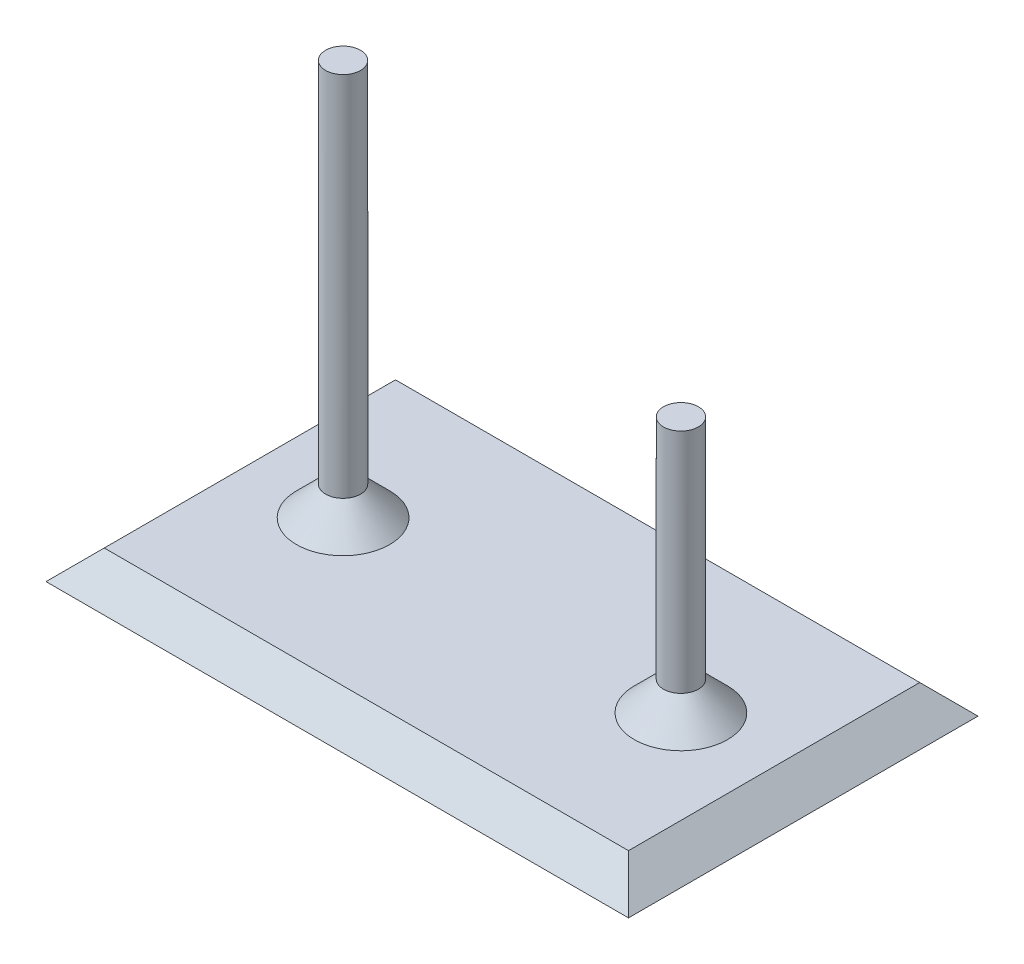
ISO-10303-21;
HEADER;
FILE_DESCRIPTION(('STEP AP214'),'2;1');
FILE_NAME('part.step','',(''),(''),'','','');
FILE_SCHEMA(('AUTOMOTIVE_DESIGN { 1 0 10303 214 1 1 1 1 }'));
ENDSEC;
DATA;
#1=APPLICATION_CONTEXT('core data for automotive mechanical design processes');
#2=APPLICATION_PROTOCOL_DEFINITION('international standard','automotive_design',2000,#1);
#3=PRODUCT_CONTEXT('',#1,'mechanical');
#4=PRODUCT('Part','Part','',(#3));
#5=PRODUCT_RELATED_PRODUCT_CATEGORY('part','',(#4));
#6=PRODUCT_DEFINITION_FORMATION('','',#4);
#7=PRODUCT_DEFINITION_CONTEXT('part definition',#1,'design');
#8=PRODUCT_DEFINITION('design','',#6,#7);
#9=PRODUCT_DEFINITION_SHAPE('','',#8);
#10=(LENGTH_UNIT() NAMED_UNIT(*) SI_UNIT(.MILLI.,.METRE.));
#11=(NAMED_UNIT(*) PLANE_ANGLE_UNIT() SI_UNIT($,.RADIAN.));
#12=(NAMED_UNIT(*) SI_UNIT($,.STERADIAN.) SOLID_ANGLE_UNIT());
#13=UNCERTAINTY_MEASURE_WITH_UNIT(LENGTH_MEASURE(1.E-05),#10,'distance_accuracy_value','');
#14=(GEOMETRIC_REPRESENTATION_CONTEXT(3) GLOBAL_UNCERTAINTY_ASSIGNED_CONTEXT((#13)) GLOBAL_UNIT_ASSIGNED_CONTEXT((#10,
#11,#12)) REPRESENTATION_CONTEXT('',''));
#15=CARTESIAN_POINT('',(0.,0.,0.));
#16=DIRECTION('',(0.,0.,1.));
#17=DIRECTION('',(1.,0.,0.));
#18=AXIS2_PLACEMENT_3D('',#15,#16,#17);
#19=CARTESIAN_POINT('',(0.,3.175,0.));
#20=DIRECTION('',(0.,1.,0.));
#21=DIRECTION('',(0.,0.,1.));
#22=AXIS2_PLACEMENT_3D('',#19,#20,#21);
#23=PLANE('',#22);
#24=DIRECTION('',(0.,0.,-1.));
#25=VECTOR('',#24,1.);
#26=CARTESIAN_POINT('',(60.325,3.175,-38.1));
#27=LINE('',#26,#25);
#28=CARTESIAN_POINT('',(60.325,3.175,-3.17499999999999));
#29=VERTEX_POINT('',#28);
#30=CARTESIAN_POINT('',(60.325,3.175,-34.925));
#31=VERTEX_POINT('',#30);
#32=EDGE_CURVE('E50',#29,#31,#27,.T.);
#33=ORIENTED_EDGE('',*,*,#32,.T.);
#34=DIRECTION('',(-1.,0.,0.));
#35=VECTOR('',#34,1.);
#36=CARTESIAN_POINT('',(0.,3.175,-34.925));
#37=LINE('',#36,#35);
#38=CARTESIAN_POINT('',(3.17499999999998,3.175,-34.925));
#39=VERTEX_POINT('',#38);
#40=EDGE_CURVE('E116',#31,#39,#37,.T.);
#41=ORIENTED_EDGE('',*,*,#40,.T.);
#42=DIRECTION('',(0.,0.,1.));
#43=VECTOR('',#42,1.);
#44=CARTESIAN_POINT('',(3.17499999999999,3.175,0.));
#45=LINE('',#44,#43);
#46=CARTESIAN_POINT('',(3.17499999999999,3.175,-3.17499999999999));
#47=VERTEX_POINT('',#46);
#48=EDGE_CURVE('E112',#39,#47,#45,.T.);
#49=ORIENTED_EDGE('',*,*,#48,.T.);
#50=DIRECTION('',(1.,0.,0.));
#51=VECTOR('',#50,1.);
#52=CARTESIAN_POINT('',(63.5,3.175,-3.17499999999999));
#53=LINE('',#52,#51);
#54=EDGE_CURVE('E55',#47,#29,#53,.T.);
#55=ORIENTED_EDGE('',*,*,#54,.T.);
#56=EDGE_LOOP('',(#33,#41,#49,#55));
#57=FACE_BOUND('',#56,.T.);
#58=CARTESIAN_POINT('',(13.335,3.175,-19.05));
#59=DIRECTION('',(0.,1.,0.));
#60=DIRECTION('',(0.,0.,1.));
#61=AXIS2_PLACEMENT_3D('',#58,#59,#60);
#62=CIRCLE('',#61,5.07999999999999);
#63=CARTESIAN_POINT('',(13.335,3.175,-24.13));
#64=VERTEX_POINT('',#63);
#65=EDGE_CURVE('E109',#64,#64,#62,.F.);
#66=ORIENTED_EDGE('',*,*,#65,.T.);
#67=EDGE_LOOP('',(#66));
#68=FACE_BOUND('',#67,.T.);
#69=CARTESIAN_POINT('',(50.165,3.175,-19.05));
#70=DIRECTION('',(0.,1.,0.));
#71=DIRECTION('',(0.,0.,1.));
#72=AXIS2_PLACEMENT_3D('',#69,#70,#71);
#73=CIRCLE('',#72,5.07999999999999);
#74=CARTESIAN_POINT('',(50.165,3.175,-24.13));
#75=VERTEX_POINT('',#74);
#76=EDGE_CURVE('E106',#75,#75,#73,.F.);
#77=ORIENTED_EDGE('',*,*,#76,.T.);
#78=EDGE_LOOP('',(#77));
#79=FACE_BOUND('',#78,.T.);
#80=ADVANCED_FACE('F33',(#57,#68,#79),#23,.T.);
#81=CARTESIAN_POINT('',(0.,0.,0.));
#82=DIRECTION('',(0.,1.,0.));
#83=DIRECTION('',(0.,0.,1.));
#84=AXIS2_PLACEMENT_3D('',#81,#82,#83);
#85=PLANE('',#84);
#86=DIRECTION('',(0.,0.,1.));
#87=VECTOR('',#86,1.);
#88=CARTESIAN_POINT('',(0.,0.,-38.1));
#89=LINE('',#88,#87);
#90=CARTESIAN_POINT('',(0.,0.,-38.1));
#91=VERTEX_POINT('',#90);
#92=CARTESIAN_POINT('',(0.,0.,0.));
#93=VERTEX_POINT('',#92);
#94=EDGE_CURVE('E80',#91,#93,#89,.T.);
#95=ORIENTED_EDGE('',*,*,#94,.F.);
#96=DIRECTION('',(-1.,0.,0.));
#97=VECTOR('',#96,1.);
#98=CARTESIAN_POINT('',(0.,0.,-38.1));
#99=LINE('',#98,#97);
#100=CARTESIAN_POINT('',(63.5,0.,-38.1));
#101=VERTEX_POINT('',#100);
#102=EDGE_CURVE('E104',#101,#91,#99,.T.);
#103=ORIENTED_EDGE('',*,*,#102,.F.);
#104=DIRECTION('',(0.,0.,-1.));
#105=VECTOR('',#104,1.);
#106=CARTESIAN_POINT('',(63.5,0.,-38.1));
#107=LINE('',#106,#105);
#108=CARTESIAN_POINT('',(63.5,0.,0.));
#109=VERTEX_POINT('',#108);
#110=EDGE_CURVE('E83',#109,#101,#107,.T.);
#111=ORIENTED_EDGE('',*,*,#110,.F.);
#112=DIRECTION('',(1.,0.,0.));
#113=VECTOR('',#112,1.);
#114=CARTESIAN_POINT('',(0.,0.,0.));
#115=LINE('',#114,#113);
#116=EDGE_CURVE('E75',#93,#109,#115,.T.);
#117=ORIENTED_EDGE('',*,*,#116,.F.);
#118=EDGE_LOOP('',(#95,#103,#111,#117));
#119=FACE_BOUND('',#118,.T.);
#120=ADVANCED_FACE('F77',(#119),#85,.F.);
#121=CARTESIAN_POINT('',(13.335,31.115,-19.05));
#122=DIRECTION('',(0.,-1.,0.));
#123=DIRECTION('',(0.,0.,-1.));
#124=AXIS2_PLACEMENT_3D('',#121,#122,#123);
#125=CYLINDRICAL_SURFACE('',#124,1.905);
#126=CARTESIAN_POINT('',(13.335,6.35000000000002,-19.05));
#127=DIRECTION('',(0.,1.,0.));
#128=DIRECTION('',(0.,0.,1.));
#129=AXIS2_PLACEMENT_3D('',#126,#127,#128);
#130=CIRCLE('',#129,1.905);
#131=CARTESIAN_POINT('',(13.335,6.35000000000002,-20.955));
#132=VERTEX_POINT('',#131);
#133=EDGE_CURVE('E42',#132,#132,#130,.T.);
#134=ORIENTED_EDGE('',*,*,#133,.T.);
#135=EDGE_LOOP('',(#134));
#136=FACE_BOUND('',#135,.T.);
#137=CARTESIAN_POINT('',(13.335,46.355,-19.05));
#138=DIRECTION('',(0.,1.,0.));
#139=DIRECTION('',(0.,0.,1.));
#140=AXIS2_PLACEMENT_3D('',#137,#138,#139);
#141=CIRCLE('',#140,1.905);
#142=CARTESIAN_POINT('',(13.335,46.355,-17.145));
#143=VERTEX_POINT('',#142);
#144=EDGE_CURVE('E99',#143,#143,#141,.T.);
#145=ORIENTED_EDGE('',*,*,#144,.F.);
#146=EDGE_LOOP('',(#145));
#147=FACE_BOUND('',#146,.T.);
#148=ADVANCED_FACE('F131',(#136,#147),#125,.T.);
#149=CARTESIAN_POINT('',(50.165,31.115,-19.05));
#150=DIRECTION('',(0.,-1.,0.));
#151=DIRECTION('',(0.,0.,-1.));
#152=AXIS2_PLACEMENT_3D('',#149,#150,#151);
#153=CYLINDRICAL_SURFACE('',#152,1.905);
#154=CARTESIAN_POINT('',(50.165,6.35000000000002,-19.05));
#155=DIRECTION('',(0.,1.,0.));
#156=DIRECTION('',(0.,0.,1.));
#157=AXIS2_PLACEMENT_3D('',#154,#155,#156);
#158=CIRCLE('',#157,1.905);
#159=CARTESIAN_POINT('',(50.165,6.35000000000002,-20.955));
#160=VERTEX_POINT('',#159);
#161=EDGE_CURVE('E11',#160,#160,#158,.T.);
#162=ORIENTED_EDGE('',*,*,#161,.T.);
#163=EDGE_LOOP('',(#162));
#164=FACE_BOUND('',#163,.T.);
#165=CARTESIAN_POINT('',(50.165,31.115,-19.05));
#166=DIRECTION('',(0.,1.,0.));
#167=DIRECTION('',(0.,0.,1.));
#168=AXIS2_PLACEMENT_3D('',#165,#166,#167);
#169=CIRCLE('',#168,1.905);
#170=CARTESIAN_POINT('',(50.165,31.115,-17.145));
#171=VERTEX_POINT('',#170);
#172=EDGE_CURVE('E96',#171,#171,#169,.T.);
#173=ORIENTED_EDGE('',*,*,#172,.F.);
#174=EDGE_LOOP('',(#173));
#175=FACE_BOUND('',#174,.T.);
#176=ADVANCED_FACE('F133',(#164,#175),#153,.T.);
#177=CARTESIAN_POINT('',(50.165,31.115,-19.05));
#178=DIRECTION('',(0.,1.,0.));
#179=DIRECTION('',(0.,0.,1.));
#180=AXIS2_PLACEMENT_3D('',#177,#178,#179);
#181=PLANE('',#180);
#182=ORIENTED_EDGE('',*,*,#172,.T.);
#183=EDGE_LOOP('',(#182));
#184=FACE_BOUND('',#183,.T.);
#185=ADVANCED_FACE('F140',(#184),#181,.T.);
#186=CARTESIAN_POINT('',(13.335,46.355,-19.05));
#187=DIRECTION('',(0.,1.,0.));
#188=DIRECTION('',(0.,0.,1.));
#189=AXIS2_PLACEMENT_3D('',#186,#187,#188);
#190=PLANE('',#189);
#191=ORIENTED_EDGE('',*,*,#144,.T.);
#192=EDGE_LOOP('',(#191));
#193=FACE_BOUND('',#192,.T.);
#194=ADVANCED_FACE('F129',(#193),#190,.T.);
#195=CARTESIAN_POINT('',(0.,3.175,-3.17499999999999));
#196=DIRECTION('',(0.,0.707106781186546,0.707106781186549));
#197=DIRECTION('',(-1.,0.,0.));
#198=AXIS2_PLACEMENT_3D('',#195,#196,#197);
#199=PLANE('',#198);
#200=DIRECTION('',(0.577350269189625,0.577350269189628,-0.577350269189625));
#201=VECTOR('',#200,1.);
#202=CARTESIAN_POINT('',(2.11666666666666,2.11666666666667,-2.11666666666666));
#203=LINE('',#202,#201);
#204=EDGE_CURVE('E88',#93,#47,#203,.T.);
#205=ORIENTED_EDGE('',*,*,#204,.F.);
#206=ORIENTED_EDGE('',*,*,#116,.T.);
#207=DIRECTION('',(-0.577350269189625,0.577350269189628,-0.577350269189625));
#208=VECTOR('',#207,1.);
#209=CARTESIAN_POINT('',(40.2166666666667,23.2833333333334,-23.2833333333333));
#210=LINE('',#209,#208);
#211=EDGE_CURVE('E37',#29,#109,#210,.F.);
#212=ORIENTED_EDGE('',*,*,#211,.F.);
#213=ORIENTED_EDGE('',*,*,#54,.F.);
#214=EDGE_LOOP('',(#205,#206,#212,#213));
#215=FACE_BOUND('',#214,.T.);
#216=ADVANCED_FACE('F89',(#215),#199,.T.);
#217=CARTESIAN_POINT('',(60.325,3.175,0.));
#218=DIRECTION('',(0.707106781186549,0.707106781186546,0.));
#219=DIRECTION('',(0.,0.,1.));
#220=AXIS2_PLACEMENT_3D('',#217,#218,#219);
#221=PLANE('',#220);
#222=ORIENTED_EDGE('',*,*,#211,.T.);
#223=ORIENTED_EDGE('',*,*,#110,.T.);
#224=DIRECTION('',(-0.577350269189625,0.577350269189628,0.577350269189625));
#225=VECTOR('',#224,1.);
#226=CARTESIAN_POINT('',(48.6833333333334,14.8166666666667,-23.2833333333334));
#227=LINE('',#226,#225);
#228=EDGE_CURVE('E92',#31,#101,#227,.F.);
#229=ORIENTED_EDGE('',*,*,#228,.F.);
#230=ORIENTED_EDGE('',*,*,#32,.F.);
#231=EDGE_LOOP('',(#222,#223,#229,#230));
#232=FACE_BOUND('',#231,.T.);
#233=ADVANCED_FACE('F125',(#232),#221,.T.);
#234=CARTESIAN_POINT('',(3.17499999999999,3.175,0.));
#235=DIRECTION('',(-0.707106781186549,0.707106781186546,0.));
#236=DIRECTION('',(0.,0.,-1.));
#237=AXIS2_PLACEMENT_3D('',#234,#235,#236);
#238=PLANE('',#237);
#239=ORIENTED_EDGE('',*,*,#204,.T.);
#240=ORIENTED_EDGE('',*,*,#48,.F.);
#241=DIRECTION('',(-0.577350269189625,-0.577350269189627,-0.577350269189625));
#242=VECTOR('',#241,1.);
#243=CARTESIAN_POINT('',(14.8166666666666,14.8166666666667,-23.2833333333334));
#244=LINE('',#243,#242);
#245=EDGE_CURVE('E95',#91,#39,#244,.F.);
#246=ORIENTED_EDGE('',*,*,#245,.F.);
#247=ORIENTED_EDGE('',*,*,#94,.T.);
#248=EDGE_LOOP('',(#239,#240,#246,#247));
#249=FACE_BOUND('',#248,.T.);
#250=ADVANCED_FACE('F94',(#249),#238,.T.);
#251=CARTESIAN_POINT('',(0.,3.175,-34.925));
#252=DIRECTION('',(0.,0.707106781186546,-0.707106781186549));
#253=DIRECTION('',(1.,0.,0.));
#254=AXIS2_PLACEMENT_3D('',#251,#252,#253);
#255=PLANE('',#254);
#256=ORIENTED_EDGE('',*,*,#228,.T.);
#257=ORIENTED_EDGE('',*,*,#102,.T.);
#258=ORIENTED_EDGE('',*,*,#245,.T.);
#259=ORIENTED_EDGE('',*,*,#40,.F.);
#260=EDGE_LOOP('',(#256,#257,#258,#259));
#261=FACE_BOUND('',#260,.T.);
#262=ADVANCED_FACE('F123',(#261),#255,.T.);
#263=CARTESIAN_POINT('',(13.335,6.35000000000002,-19.05));
#264=DIRECTION('',(0.,-1.,0.));
#265=DIRECTION('',(0.,0.,-1.));
#266=AXIS2_PLACEMENT_3D('',#263,#264,#265);
#267=CONICAL_SURFACE('',#266,1.905,0.785398163397444);
#268=CARTESIAN_POINT('',(13.335,3.175,-24.13));
#269=CARTESIAN_POINT('',(13.335,3.20807291666667,-24.0969270833333));
#270=CARTESIAN_POINT('',(13.335,3.24114583333333,-24.0638541666667));
#271=CARTESIAN_POINT('',(13.335,3.30729166666667,-23.9977083333333));
#272=CARTESIAN_POINT('',(13.335,3.34036458333333,-23.9646354166667));
#273=CARTESIAN_POINT('',(13.335,3.40651041666667,-23.8984895833333));
#274=CARTESIAN_POINT('',(13.335,3.43958333333333,-23.8654166666667));
#275=CARTESIAN_POINT('',(13.335,3.50572916666667,-23.7992708333333));
#276=CARTESIAN_POINT('',(13.335,3.53880208333333,-23.7661979166667));
#277=CARTESIAN_POINT('',(13.335,3.60494791666667,-23.7000520833333));
#278=CARTESIAN_POINT('',(13.335,3.63802083333334,-23.6669791666667));
#279=CARTESIAN_POINT('',(13.335,3.70416666666667,-23.6008333333333));
#280=CARTESIAN_POINT('',(13.335,3.73723958333334,-23.5677604166667));
#281=CARTESIAN_POINT('',(13.335,3.80338541666667,-23.5016145833333));
#282=CARTESIAN_POINT('',(13.335,3.83645833333334,-23.4685416666667));
#283=CARTESIAN_POINT('',(13.335,3.90260416666667,-23.4023958333333));
#284=CARTESIAN_POINT('',(13.335,3.93567708333334,-23.3693229166667));
#285=CARTESIAN_POINT('',(13.335,4.00182291666667,-23.3031770833333));
#286=CARTESIAN_POINT('',(13.335,4.03489583333334,-23.2701041666667));
#287=CARTESIAN_POINT('',(13.335,4.10104166666667,-23.2039583333333));
#288=CARTESIAN_POINT('',(13.335,4.13411458333334,-23.1708854166667));
#289=CARTESIAN_POINT('',(13.335,4.20026041666667,-23.1047395833333));
#290=CARTESIAN_POINT('',(13.335,4.23333333333334,-23.0716666666667));
#291=CARTESIAN_POINT('',(13.335,4.29947916666667,-23.0055208333333));
#292=CARTESIAN_POINT('',(13.335,4.33255208333334,-22.9724479166667));
#293=CARTESIAN_POINT('',(13.335,4.39869791666667,-22.9063020833333));
#294=CARTESIAN_POINT('',(13.335,4.43177083333334,-22.8732291666667));
#295=CARTESIAN_POINT('',(13.335,4.49791666666667,-22.8070833333333));
#296=CARTESIAN_POINT('',(13.335,4.53098958333334,-22.7740104166667));
#297=CARTESIAN_POINT('',(13.335,4.59713541666667,-22.7078645833333));
#298=CARTESIAN_POINT('',(13.335,4.63020833333334,-22.6747916666667));
#299=CARTESIAN_POINT('',(13.335,4.69635416666667,-22.6086458333333));
#300=CARTESIAN_POINT('',(13.335,4.72942708333334,-22.5755729166667));
#301=CARTESIAN_POINT('',(13.335,4.79557291666667,-22.5094270833333));
#302=CARTESIAN_POINT('',(13.335,4.82864583333334,-22.4763541666667));
#303=CARTESIAN_POINT('',(13.335,4.89479166666667,-22.4102083333333));
#304=CARTESIAN_POINT('',(13.335,4.92786458333334,-22.3771354166667));
#305=CARTESIAN_POINT('',(13.335,4.99401041666668,-22.3109895833333));
#306=CARTESIAN_POINT('',(13.335,5.02708333333334,-22.2779166666667));
#307=CARTESIAN_POINT('',(13.335,5.09322916666668,-22.2117708333333));
#308=CARTESIAN_POINT('',(13.335,5.12630208333334,-22.1786979166667));
#309=CARTESIAN_POINT('',(13.335,5.19244791666668,-22.1125520833333));
#310=CARTESIAN_POINT('',(13.335,5.22552083333334,-22.0794791666667));
#311=CARTESIAN_POINT('',(13.335,5.29166666666668,-22.0133333333333));
#312=CARTESIAN_POINT('',(13.335,5.32473958333334,-21.9802604166667));
#313=CARTESIAN_POINT('',(13.335,5.39088541666668,-21.9141145833333));
#314=CARTESIAN_POINT('',(13.335,5.42395833333334,-21.8810416666667));
#315=CARTESIAN_POINT('',(13.335,5.49010416666668,-21.8148958333333));
#316=CARTESIAN_POINT('',(13.335,5.52317708333334,-21.7818229166667));
#317=CARTESIAN_POINT('',(13.335,5.58932291666668,-21.7156770833333));
#318=CARTESIAN_POINT('',(13.335,5.62239583333335,-21.6826041666667));
#319=CARTESIAN_POINT('',(13.335,5.68854166666668,-21.6164583333333));
#320=CARTESIAN_POINT('',(13.335,5.72161458333334,-21.5833854166667));
#321=CARTESIAN_POINT('',(13.335,5.78776041666668,-21.5172395833333));
#322=CARTESIAN_POINT('',(13.335,5.82083333333335,-21.4841666666667));
#323=CARTESIAN_POINT('',(13.335,5.88697916666668,-21.4180208333333));
#324=CARTESIAN_POINT('',(13.335,5.92005208333335,-21.3849479166667));
#325=CARTESIAN_POINT('',(13.335,5.98619791666668,-21.3188020833333));
#326=CARTESIAN_POINT('',(13.335,6.01927083333335,-21.2857291666667));
#327=CARTESIAN_POINT('',(13.335,6.08541666666668,-21.2195833333333));
#328=CARTESIAN_POINT('',(13.335,6.11848958333335,-21.1865104166667));
#329=CARTESIAN_POINT('',(13.335,6.18463541666668,-21.1203645833333));
#330=CARTESIAN_POINT('',(13.335,6.21770833333335,-21.0872916666667));
#331=CARTESIAN_POINT('',(13.335,6.28385416666668,-21.0211458333333));
#332=CARTESIAN_POINT('',(13.335,6.31692708333335,-20.9880729166667));
#333=CARTESIAN_POINT('',(13.335,6.35000000000002,-20.955));
#334=B_SPLINE_CURVE_WITH_KNOTS('',3,(#268,#269,#270,#271,#272,#273,#274,#275,#276,#277,#278,
#279,#280,#281,#282,#283,#284,#285,#286,#287,#288,#289,#290,#291,#292,#293,#294,#295,#296,#297,
#298,#299,#300,#301,#302,#303,#304,#305,#306,#307,#308,#309,#310,#311,#312,#313,#314,#315,#316,
#317,#318,#319,#320,#321,#322,#323,#324,#325,#326,#327,#328,#329,#330,#331,#332,#333),
.UNSPECIFIED.,.F.,.F.,(4,2,2,2,2,2,2,2,2,2,2,2,2,2,2,2,2,2,2,2,2,2,2,2,2,2,2,2,2,2,2,2,4),(0.,
0.140316501891707,0.280633003783414,0.420949505675118,0.561266007566822,0.701582509458529,
0.841899011350235,0.98221551324194,1.12253201513365,1.26284851702535,1.40316501891706,
1.54348152080876,1.68379802270047,1.82411452459218,1.96443102648388,2.10474752837559,
2.24506403026729,2.385380532159,2.5256970340507,2.66601353594241,2.80633003783411,
2.94664653972582,3.08696304161752,3.22727954350923,3.36759604540094,3.50791254729264,
3.64822904918435,3.78854555107605,3.92886205296776,4.06917855485946,4.20949505675117,
4.34981155864288,4.49012806053458),.UNSPECIFIED.);
#335=EDGE_CURVE('BSEAM152',#64,#132,#334,.T.);
#336=ORIENTED_EDGE('',*,*,#65,.F.);
#337=ORIENTED_EDGE('',*,*,#133,.F.);
#338=ORIENTED_EDGE('',*,*,#335,.T.);
#339=ORIENTED_EDGE('',*,*,#335,.F.);
#340=EDGE_LOOP('',(#336,#338,#337,#339));
#341=FACE_BOUND('',#340,.T.);
#342=ADVANCED_FACE('F152',(#341),#267,.T.);
#343=CARTESIAN_POINT('',(50.165,6.35000000000002,-19.05));
#344=DIRECTION('',(0.,-1.,0.));
#345=DIRECTION('',(0.,0.,-1.));
#346=AXIS2_PLACEMENT_3D('',#343,#344,#345);
#347=CONICAL_SURFACE('',#346,1.905,0.785398163397444);
#348=CARTESIAN_POINT('',(50.165,3.175,-24.13));
#349=CARTESIAN_POINT('',(50.165,3.20807291666667,-24.0969270833333));
#350=CARTESIAN_POINT('',(50.165,3.24114583333333,-24.0638541666667));
#351=CARTESIAN_POINT('',(50.165,3.30729166666667,-23.9977083333333));
#352=CARTESIAN_POINT('',(50.165,3.34036458333333,-23.9646354166667));
#353=CARTESIAN_POINT('',(50.165,3.40651041666667,-23.8984895833333));
#354=CARTESIAN_POINT('',(50.165,3.43958333333333,-23.8654166666667));
#355=CARTESIAN_POINT('',(50.165,3.50572916666667,-23.7992708333333));
#356=CARTESIAN_POINT('',(50.165,3.53880208333333,-23.7661979166667));
#357=CARTESIAN_POINT('',(50.165,3.60494791666667,-23.7000520833333));
#358=CARTESIAN_POINT('',(50.165,3.63802083333334,-23.6669791666667));
#359=CARTESIAN_POINT('',(50.165,3.70416666666667,-23.6008333333333));
#360=CARTESIAN_POINT('',(50.165,3.73723958333334,-23.5677604166667));
#361=CARTESIAN_POINT('',(50.165,3.80338541666667,-23.5016145833333));
#362=CARTESIAN_POINT('',(50.165,3.83645833333334,-23.4685416666667));
#363=CARTESIAN_POINT('',(50.165,3.90260416666667,-23.4023958333333));
#364=CARTESIAN_POINT('',(50.165,3.93567708333334,-23.3693229166667));
#365=CARTESIAN_POINT('',(50.165,4.00182291666667,-23.3031770833333));
#366=CARTESIAN_POINT('',(50.165,4.03489583333334,-23.2701041666667));
#367=CARTESIAN_POINT('',(50.165,4.10104166666667,-23.2039583333333));
#368=CARTESIAN_POINT('',(50.165,4.13411458333334,-23.1708854166667));
#369=CARTESIAN_POINT('',(50.165,4.20026041666667,-23.1047395833333));
#370=CARTESIAN_POINT('',(50.165,4.23333333333334,-23.0716666666667));
#371=CARTESIAN_POINT('',(50.165,4.29947916666667,-23.0055208333333));
#372=CARTESIAN_POINT('',(50.165,4.33255208333334,-22.9724479166667));
#373=CARTESIAN_POINT('',(50.165,4.39869791666667,-22.9063020833333));
#374=CARTESIAN_POINT('',(50.165,4.43177083333334,-22.8732291666667));
#375=CARTESIAN_POINT('',(50.165,4.49791666666667,-22.8070833333333));
#376=CARTESIAN_POINT('',(50.165,4.53098958333334,-22.7740104166667));
#377=CARTESIAN_POINT('',(50.165,4.59713541666667,-22.7078645833333));
#378=CARTESIAN_POINT('',(50.165,4.63020833333334,-22.6747916666667));
#379=CARTESIAN_POINT('',(50.165,4.69635416666667,-22.6086458333333));
#380=CARTESIAN_POINT('',(50.165,4.72942708333334,-22.5755729166667));
#381=CARTESIAN_POINT('',(50.165,4.79557291666667,-22.5094270833333));
#382=CARTESIAN_POINT('',(50.165,4.82864583333334,-22.4763541666667));
#383=CARTESIAN_POINT('',(50.165,4.89479166666667,-22.4102083333333));
#384=CARTESIAN_POINT('',(50.165,4.92786458333334,-22.3771354166667));
#385=CARTESIAN_POINT('',(50.165,4.99401041666668,-22.3109895833333));
#386=CARTESIAN_POINT('',(50.165,5.02708333333334,-22.2779166666667));
#387=CARTESIAN_POINT('',(50.165,5.09322916666668,-22.2117708333333));
#388=CARTESIAN_POINT('',(50.165,5.12630208333334,-22.1786979166667));
#389=CARTESIAN_POINT('',(50.165,5.19244791666668,-22.1125520833333));
#390=CARTESIAN_POINT('',(50.165,5.22552083333334,-22.0794791666667));
#391=CARTESIAN_POINT('',(50.165,5.29166666666668,-22.0133333333333));
#392=CARTESIAN_POINT('',(50.165,5.32473958333334,-21.9802604166667));
#393=CARTESIAN_POINT('',(50.165,5.39088541666668,-21.9141145833333));
#394=CARTESIAN_POINT('',(50.165,5.42395833333334,-21.8810416666667));
#395=CARTESIAN_POINT('',(50.165,5.49010416666668,-21.8148958333333));
#396=CARTESIAN_POINT('',(50.165,5.52317708333334,-21.7818229166667));
#397=CARTESIAN_POINT('',(50.165,5.58932291666668,-21.7156770833333));
#398=CARTESIAN_POINT('',(50.165,5.62239583333335,-21.6826041666667));
#399=CARTESIAN_POINT('',(50.165,5.68854166666668,-21.6164583333333));
#400=CARTESIAN_POINT('',(50.165,5.72161458333334,-21.5833854166667));
#401=CARTESIAN_POINT('',(50.165,5.78776041666668,-21.5172395833333));
#402=CARTESIAN_POINT('',(50.165,5.82083333333335,-21.4841666666667));
#403=CARTESIAN_POINT('',(50.165,5.88697916666668,-21.4180208333333));
#404=CARTESIAN_POINT('',(50.165,5.92005208333335,-21.3849479166667));
#405=CARTESIAN_POINT('',(50.165,5.98619791666668,-21.3188020833333));
#406=CARTESIAN_POINT('',(50.165,6.01927083333335,-21.2857291666667));
#407=CARTESIAN_POINT('',(50.165,6.08541666666668,-21.2195833333333));
#408=CARTESIAN_POINT('',(50.165,6.11848958333335,-21.1865104166667));
#409=CARTESIAN_POINT('',(50.165,6.18463541666668,-21.1203645833333));
#410=CARTESIAN_POINT('',(50.165,6.21770833333335,-21.0872916666667));
#411=CARTESIAN_POINT('',(50.165,6.28385416666668,-21.0211458333333));
#412=CARTESIAN_POINT('',(50.165,6.31692708333335,-20.9880729166667));
#413=CARTESIAN_POINT('',(50.165,6.35000000000002,-20.955));
#414=B_SPLINE_CURVE_WITH_KNOTS('',3,(#348,#349,#350,#351,#352,#353,#354,#355,#356,#357,#358,
#359,#360,#361,#362,#363,#364,#365,#366,#367,#368,#369,#370,#371,#372,#373,#374,#375,#376,#377,
#378,#379,#380,#381,#382,#383,#384,#385,#386,#387,#388,#389,#390,#391,#392,#393,#394,#395,#396,
#397,#398,#399,#400,#401,#402,#403,#404,#405,#406,#407,#408,#409,#410,#411,#412,#413),
.UNSPECIFIED.,.F.,.F.,(4,2,2,2,2,2,2,2,2,2,2,2,2,2,2,2,2,2,2,2,2,2,2,2,2,2,2,2,2,2,2,2,4),(0.,
0.140316501891707,0.280633003783414,0.420949505675118,0.561266007566822,0.701582509458529,
0.841899011350235,0.98221551324194,1.12253201513365,1.26284851702535,1.40316501891706,
1.54348152080876,1.68379802270047,1.82411452459218,1.96443102648388,2.10474752837559,
2.24506403026729,2.385380532159,2.5256970340507,2.66601353594241,2.80633003783411,
2.94664653972582,3.08696304161752,3.22727954350923,3.36759604540094,3.50791254729264,
3.64822904918435,3.78854555107605,3.92886205296776,4.06917855485946,4.20949505675117,
4.34981155864288,4.49012806053458),.UNSPECIFIED.);
#415=EDGE_CURVE('BSEAM35',#75,#160,#414,.T.);
#416=ORIENTED_EDGE('',*,*,#76,.F.);
#417=ORIENTED_EDGE('',*,*,#161,.F.);
#418=ORIENTED_EDGE('',*,*,#415,.T.);
#419=ORIENTED_EDGE('',*,*,#415,.F.);
#420=EDGE_LOOP('',(#416,#418,#417,#419));
#421=FACE_BOUND('',#420,.T.);
#422=ADVANCED_FACE('F35',(#421),#347,.T.);
#423=CLOSED_SHELL('',(#80,#120,#148,#176,#185,#194,#216,#233,#250,#262,#342,#422));
#424=MANIFOLD_SOLID_BREP('B2',#423);
#425=ADVANCED_BREP_SHAPE_REPRESENTATION('',(#18,#424),#14);
#426=SHAPE_DEFINITION_REPRESENTATION(#9,#425);
ENDSEC;
END-ISO-10303-21;
